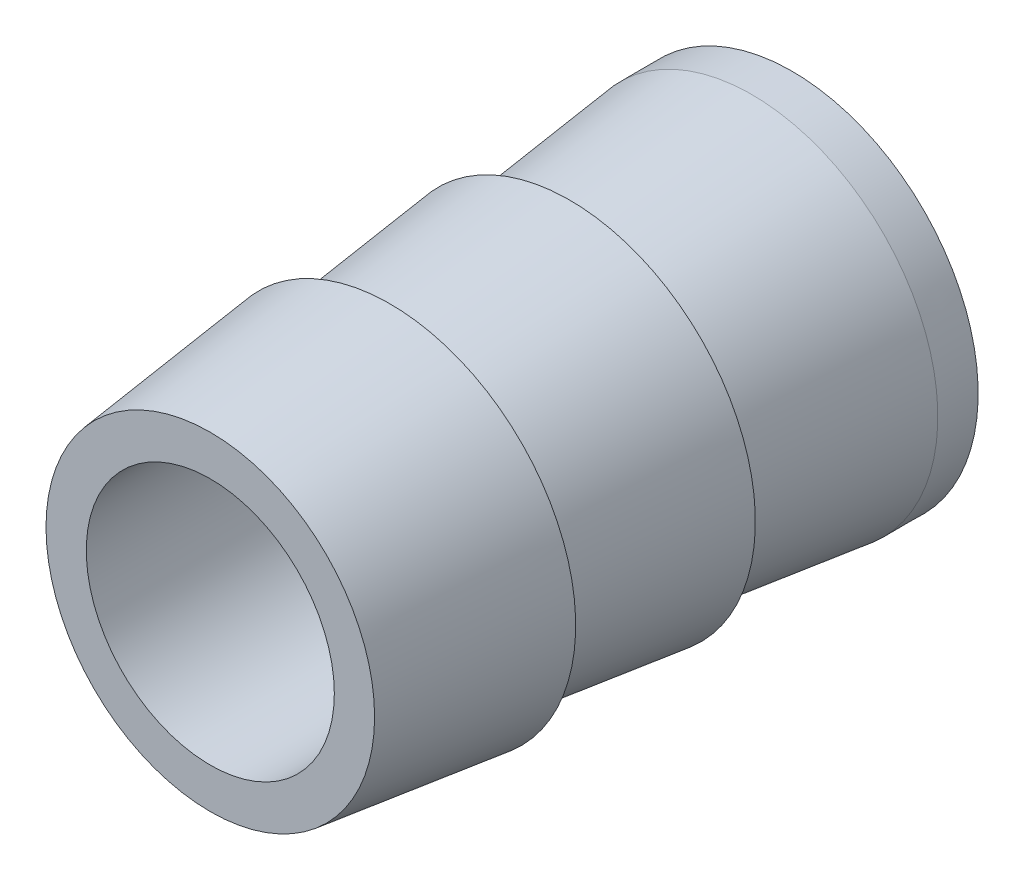
ISO-10303-21;
HEADER;
FILE_DESCRIPTION(('STEP AP214'),'2;1');
FILE_NAME('part.step','',(''),(''),'','','');
FILE_SCHEMA(('AUTOMOTIVE_DESIGN { 1 0 10303 214 1 1 1 1 }'));
ENDSEC;
DATA;
#1=APPLICATION_CONTEXT('core data for automotive mechanical design processes');
#2=APPLICATION_PROTOCOL_DEFINITION('international standard','automotive_design',2000,#1);
#3=PRODUCT_CONTEXT('',#1,'mechanical');
#4=PRODUCT('Part','Part','',(#3));
#5=PRODUCT_RELATED_PRODUCT_CATEGORY('part','',(#4));
#6=PRODUCT_DEFINITION_FORMATION('','',#4);
#7=PRODUCT_DEFINITION_CONTEXT('part definition',#1,'design');
#8=PRODUCT_DEFINITION('design','',#6,#7);
#9=PRODUCT_DEFINITION_SHAPE('','',#8);
#10=(LENGTH_UNIT() NAMED_UNIT(*) SI_UNIT(.MILLI.,.METRE.));
#11=(NAMED_UNIT(*) PLANE_ANGLE_UNIT() SI_UNIT($,.RADIAN.));
#12=(NAMED_UNIT(*) SI_UNIT($,.STERADIAN.) SOLID_ANGLE_UNIT());
#13=UNCERTAINTY_MEASURE_WITH_UNIT(LENGTH_MEASURE(1.E-05),#10,'distance_accuracy_value','');
#14=(GEOMETRIC_REPRESENTATION_CONTEXT(3) GLOBAL_UNCERTAINTY_ASSIGNED_CONTEXT((#13)) GLOBAL_UNIT_ASSIGNED_CONTEXT((#10,
#11,#12)) REPRESENTATION_CONTEXT('',''));
#15=CARTESIAN_POINT('',(0.,0.,0.));
#16=DIRECTION('',(0.,0.,1.));
#17=DIRECTION('',(1.,0.,0.));
#18=AXIS2_PLACEMENT_3D('',#15,#16,#17);
#19=CARTESIAN_POINT('',(0.,0.,6.15468318552619));
#20=DIRECTION('',(0.,0.,1.));
#21=DIRECTION('',(1.,0.,0.));
#22=AXIS2_PLACEMENT_3D('',#19,#20,#21);
#23=PLANE('',#22);
#24=CARTESIAN_POINT('',(0.,0.,6.15468318552619));
#25=DIRECTION('',(0.,0.,1.));
#26=DIRECTION('',(1.,0.,0.));
#27=AXIS2_PLACEMENT_3D('',#24,#25,#26);
#28=CIRCLE('',#27,3.175);
#29=CARTESIAN_POINT('',(3.175,0.,6.15468318552619));
#30=VERTEX_POINT('',#29);
#31=EDGE_CURVE('E70',#30,#30,#28,.T.);
#32=ORIENTED_EDGE('',*,*,#31,.F.);
#33=EDGE_LOOP('',(#32));
#34=FACE_BOUND('',#33,.T.);
#35=CARTESIAN_POINT('',(0.,0.,6.15468318552619));
#36=DIRECTION('',(0.,0.,-1.));
#37=DIRECTION('',(-1.,0.,0.));
#38=AXIS2_PLACEMENT_3D('',#35,#36,#37);
#39=CIRCLE('',#38,4.20593499387177);
#40=CARTESIAN_POINT('',(-4.20593499387177,0.,6.15468318552619));
#41=VERTEX_POINT('',#40);
#42=EDGE_CURVE('E66',#41,#41,#39,.T.);
#43=ORIENTED_EDGE('',*,*,#42,.F.);
#44=EDGE_LOOP('',(#43));
#45=FACE_BOUND('',#44,.T.);
#46=ADVANCED_FACE('F41',(#34,#45),#23,.T.);
#47=CARTESIAN_POINT('',(0.,4.7625,-8.7391875));
#48=DIRECTION('',(0.,0.,-1.));
#49=DIRECTION('',(-1.,0.,0.));
#50=AXIS2_PLACEMENT_3D('',#47,#48,#49);
#51=PLANE('',#50);
#52=CARTESIAN_POINT('',(0.,0.,-8.7391875));
#53=DIRECTION('',(0.,0.,1.));
#54=DIRECTION('',(1.,0.,0.));
#55=AXIS2_PLACEMENT_3D('',#52,#53,#54);
#56=CIRCLE('',#55,3.175);
#57=CARTESIAN_POINT('',(3.175,0.,-8.7391875));
#58=VERTEX_POINT('',#57);
#59=EDGE_CURVE('E69',#58,#58,#56,.T.);
#60=ORIENTED_EDGE('',*,*,#59,.T.);
#61=EDGE_LOOP('',(#60));
#62=FACE_BOUND('',#61,.T.);
#63=CARTESIAN_POINT('',(0.,0.,-8.7391875));
#64=DIRECTION('',(0.,0.,-1.));
#65=DIRECTION('',(-1.,0.,0.));
#66=AXIS2_PLACEMENT_3D('',#63,#64,#65);
#67=CIRCLE('',#66,4.7625);
#68=CARTESIAN_POINT('',(-4.7625,0.,-8.7391875));
#69=VERTEX_POINT('',#68);
#70=EDGE_CURVE('E10',#69,#69,#67,.T.);
#71=ORIENTED_EDGE('',*,*,#70,.T.);
#72=EDGE_LOOP('',(#71));
#73=FACE_BOUND('',#72,.T.);
#74=ADVANCED_FACE('F76',(#62,#73),#51,.T.);
#75=CARTESIAN_POINT('',(0.,0.,-8.7391875));
#76=DIRECTION('',(0.,0.,-1.));
#77=DIRECTION('',(-1.,0.,0.));
#78=AXIS2_PLACEMENT_3D('',#75,#76,#77);
#79=CONICAL_SURFACE('',#78,4.7625,0.00129577300523624);
#80=CARTESIAN_POINT('',(0.,0.,-7.70799669082972));
#81=DIRECTION('',(0.,0.,-1.));
#82=DIRECTION('',(-1.,0.,0.));
#83=AXIS2_PLACEMENT_3D('',#80,#81,#82);
#84=CIRCLE('',#83,4.7611638100384);
#85=CARTESIAN_POINT('',(-4.7611638100384,0.,-7.70799669082972));
#86=VERTEX_POINT('',#85);
#87=EDGE_CURVE('E47',#86,#86,#84,.T.);
#88=ORIENTED_EDGE('',*,*,#87,.T.);
#89=EDGE_LOOP('',(#88));
#90=FACE_BOUND('',#89,.T.);
#91=ORIENTED_EDGE('',*,*,#70,.F.);
#92=EDGE_LOOP('',(#91));
#93=FACE_BOUND('',#92,.T.);
#94=ADVANCED_FACE('F115',(#90,#93),#79,.T.);
#95=CARTESIAN_POINT('',(0.,0.,-3.19399568552619));
#96=DIRECTION('',(0.,0.,-1.));
#97=DIRECTION('',(-1.,0.,0.));
#98=AXIS2_PLACEMENT_3D('',#95,#96,#97);
#99=CONICAL_SURFACE('',#98,4.22369000612823,0.118510215194434);
#100=CARTESIAN_POINT('',(0.,0.,-3.04487931447382));
#101=DIRECTION('',(0.,0.,-1.));
#102=DIRECTION('',(-1.,0.,0.));
#103=AXIS2_PLACEMENT_3D('',#100,#101,#102);
#104=CIRCLE('',#103,4.20593499387178);
#105=CARTESIAN_POINT('',(-4.20593499387178,0.,-3.04487931447382));
#106=VERTEX_POINT('',#105);
#107=EDGE_CURVE('E51',#106,#106,#104,.T.);
#108=ORIENTED_EDGE('',*,*,#107,.T.);
#109=EDGE_LOOP('',(#108));
#110=FACE_BOUND('',#109,.T.);
#111=ORIENTED_EDGE('',*,*,#87,.F.);
#112=EDGE_LOOP('',(#111));
#113=FACE_BOUND('',#112,.T.);
#114=ADVANCED_FACE('F109',(#110,#113),#99,.T.);
#115=CARTESIAN_POINT('',(0.,4.75362249387177,-3.04487931447382));
#116=DIRECTION('',(0.,0.,-1.));
#117=DIRECTION('',(-1.,0.,0.));
#118=AXIS2_PLACEMENT_3D('',#115,#116,#117);
#119=PLANE('',#118);
#120=CARTESIAN_POINT('',(0.,0.,-3.04487931447382));
#121=DIRECTION('',(0.,0.,-1.));
#122=DIRECTION('',(-1.,0.,0.));
#123=AXIS2_PLACEMENT_3D('',#120,#121,#122);
#124=CIRCLE('',#123,4.75362249387177);
#125=CARTESIAN_POINT('',(-4.75362249387177,0.,-3.04487931447382));
#126=VERTEX_POINT('',#125);
#127=EDGE_CURVE('E55',#126,#126,#124,.T.);
#128=ORIENTED_EDGE('',*,*,#127,.T.);
#129=EDGE_LOOP('',(#128));
#130=FACE_BOUND('',#129,.T.);
#131=ORIENTED_EDGE('',*,*,#107,.F.);
#132=EDGE_LOOP('',(#131));
#133=FACE_BOUND('',#132,.T.);
#134=ADVANCED_FACE('F103',(#130,#133),#119,.T.);
#135=CARTESIAN_POINT('',(0.,0.,1.40578556447381));
#136=DIRECTION('',(0.,0.,-1.));
#137=DIRECTION('',(-1.,0.,0.));
#138=AXIS2_PLACEMENT_3D('',#135,#136,#137);
#139=CONICAL_SURFACE('',#138,4.22369000612823,0.118510215194432);
#140=CARTESIAN_POINT('',(0.,0.,1.55490193552618));
#141=DIRECTION('',(0.,0.,-1.));
#142=DIRECTION('',(-1.,0.,0.));
#143=AXIS2_PLACEMENT_3D('',#140,#141,#142);
#144=CIRCLE('',#143,4.20593499387178);
#145=CARTESIAN_POINT('',(-4.20593499387178,0.,1.55490193552618));
#146=VERTEX_POINT('',#145);
#147=EDGE_CURVE('E60',#146,#146,#144,.T.);
#148=ORIENTED_EDGE('',*,*,#147,.T.);
#149=EDGE_LOOP('',(#148));
#150=FACE_BOUND('',#149,.T.);
#151=ORIENTED_EDGE('',*,*,#127,.F.);
#152=EDGE_LOOP('',(#151));
#153=FACE_BOUND('',#152,.T.);
#154=ADVANCED_FACE('F97',(#150,#153),#139,.T.);
#155=CARTESIAN_POINT('',(0.,4.75362249387178,1.55490193552618));
#156=DIRECTION('',(0.,0.,-1.));
#157=DIRECTION('',(-1.,0.,0.));
#158=AXIS2_PLACEMENT_3D('',#155,#156,#157);
#159=PLANE('',#158);
#160=CARTESIAN_POINT('',(0.,0.,1.55490193552618));
#161=DIRECTION('',(0.,0.,-1.));
#162=DIRECTION('',(-1.,0.,0.));
#163=AXIS2_PLACEMENT_3D('',#160,#161,#162);
#164=CIRCLE('',#163,4.75362249387178);
#165=CARTESIAN_POINT('',(-4.75362249387178,0.,1.55490193552618));
#166=VERTEX_POINT('',#165);
#167=EDGE_CURVE('E63',#166,#166,#164,.T.);
#168=ORIENTED_EDGE('',*,*,#167,.T.);
#169=EDGE_LOOP('',(#168));
#170=FACE_BOUND('',#169,.T.);
#171=ORIENTED_EDGE('',*,*,#147,.F.);
#172=EDGE_LOOP('',(#171));
#173=FACE_BOUND('',#172,.T.);
#174=ADVANCED_FACE('F91',(#170,#173),#159,.T.);
#175=CARTESIAN_POINT('',(0.,0.,6.00556681447381));
#176=DIRECTION('',(0.,0.,-1.));
#177=DIRECTION('',(-1.,0.,0.));
#178=AXIS2_PLACEMENT_3D('',#175,#176,#177);
#179=CONICAL_SURFACE('',#178,4.22369000612823,0.118510215194436);
#180=ORIENTED_EDGE('',*,*,#42,.T.);
#181=EDGE_LOOP('',(#180));
#182=FACE_BOUND('',#181,.T.);
#183=ORIENTED_EDGE('',*,*,#167,.F.);
#184=EDGE_LOOP('',(#183));
#185=FACE_BOUND('',#184,.T.);
#186=ADVANCED_FACE('F81',(#182,#185),#179,.T.);
#187=CARTESIAN_POINT('',(0.,0.,-8.7391875));
#188=DIRECTION('',(0.,0.,1.));
#189=DIRECTION('',(1.,0.,0.));
#190=AXIS2_PLACEMENT_3D('',#187,#188,#189);
#191=CYLINDRICAL_SURFACE('',#190,3.175);
#192=ORIENTED_EDGE('',*,*,#59,.F.);
#193=EDGE_LOOP('',(#192));
#194=FACE_BOUND('',#193,.T.);
#195=ORIENTED_EDGE('',*,*,#31,.T.);
#196=EDGE_LOOP('',(#195));
#197=FACE_BOUND('',#196,.T.);
#198=ADVANCED_FACE('F78',(#194,#197),#191,.F.);
#199=CLOSED_SHELL('',(#46,#74,#94,#114,#134,#154,#174,#186,#198));
#200=MANIFOLD_SOLID_BREP('B2',#199);
#201=ADVANCED_BREP_SHAPE_REPRESENTATION('',(#18,#200),#14);
#202=SHAPE_DEFINITION_REPRESENTATION(#9,#201);
ENDSEC;
END-ISO-10303-21;
